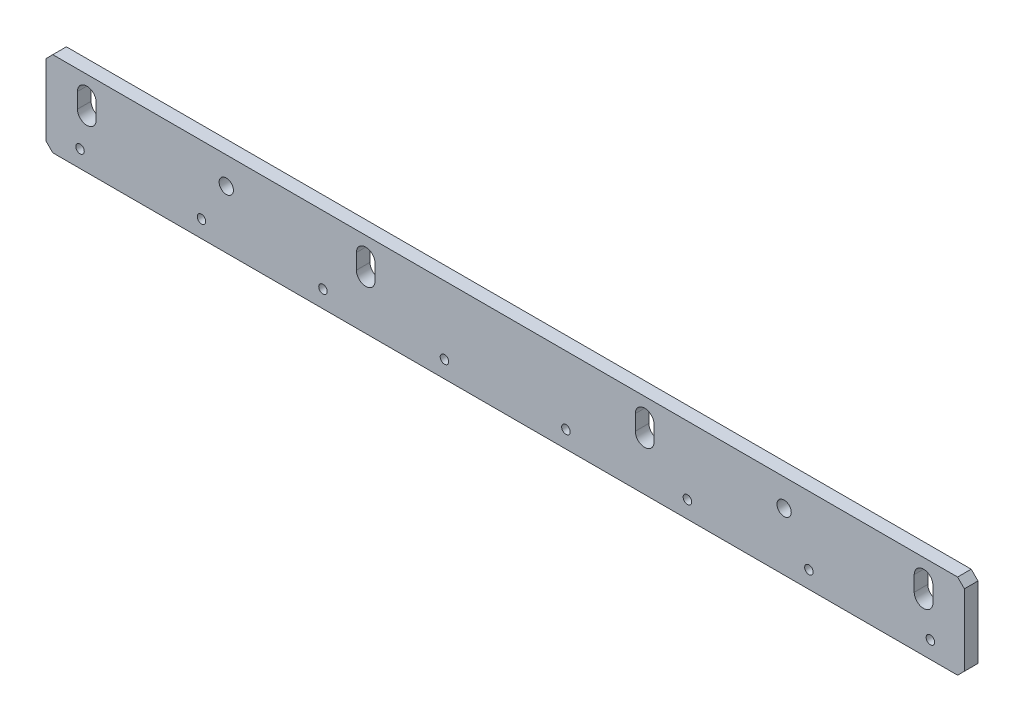
ISO-10303-21;
HEADER;
FILE_DESCRIPTION(('STEP AP214'),'2;1');
FILE_NAME('part.step','',(''),(''),'','','');
FILE_SCHEMA(('AUTOMOTIVE_DESIGN { 1 0 10303 214 1 1 1 1 }'));
ENDSEC;
DATA;
#1=APPLICATION_CONTEXT('core data for automotive mechanical design processes');
#2=APPLICATION_PROTOCOL_DEFINITION('international standard','automotive_design',2000,#1);
#3=PRODUCT_CONTEXT('',#1,'mechanical');
#4=PRODUCT('Part','Part','',(#3));
#5=PRODUCT_RELATED_PRODUCT_CATEGORY('part','',(#4));
#6=PRODUCT_DEFINITION_FORMATION('','',#4);
#7=PRODUCT_DEFINITION_CONTEXT('part definition',#1,'design');
#8=PRODUCT_DEFINITION('design','',#6,#7);
#9=PRODUCT_DEFINITION_SHAPE('','',#8);
#10=(LENGTH_UNIT() NAMED_UNIT(*) SI_UNIT(.MILLI.,.METRE.));
#11=(NAMED_UNIT(*) PLANE_ANGLE_UNIT() SI_UNIT($,.RADIAN.));
#12=(NAMED_UNIT(*) SI_UNIT($,.STERADIAN.) SOLID_ANGLE_UNIT());
#13=UNCERTAINTY_MEASURE_WITH_UNIT(LENGTH_MEASURE(1.E-05),#10,'distance_accuracy_value','');
#14=(GEOMETRIC_REPRESENTATION_CONTEXT(3) GLOBAL_UNCERTAINTY_ASSIGNED_CONTEXT((#13)) GLOBAL_UNIT_ASSIGNED_CONTEXT((#10,
#11,#12)) REPRESENTATION_CONTEXT('',''));
#15=CARTESIAN_POINT('',(0.,0.,0.));
#16=DIRECTION('',(0.,0.,1.));
#17=DIRECTION('',(1.,0.,0.));
#18=AXIS2_PLACEMENT_3D('',#15,#16,#17);
#19=CARTESIAN_POINT('',(125.,-7.49999999999999,4.));
#20=DIRECTION('',(0.,0.,1.));
#21=DIRECTION('',(1.,0.,0.));
#22=AXIS2_PLACEMENT_3D('',#19,#20,#21);
#23=CYLINDRICAL_SURFACE('',#22,1.25);
#24=CARTESIAN_POINT('',(125.,-7.49999999999999,0.));
#25=DIRECTION('',(0.,0.,1.));
#26=DIRECTION('',(1.,0.,0.));
#27=AXIS2_PLACEMENT_3D('',#24,#25,#26);
#28=CIRCLE('',#27,1.25);
#29=CARTESIAN_POINT('',(126.25,-7.49999999999999,0.));
#30=VERTEX_POINT('',#29);
#31=EDGE_CURVE('E468',#30,#30,#28,.T.);
#32=ORIENTED_EDGE('',*,*,#31,.F.);
#33=EDGE_LOOP('',(#32));
#34=FACE_BOUND('',#33,.T.);
#35=CARTESIAN_POINT('',(125.,-7.49999999999999,4.));
#36=DIRECTION('',(0.,0.,1.));
#37=DIRECTION('',(1.,0.,0.));
#38=AXIS2_PLACEMENT_3D('',#35,#36,#37);
#39=CIRCLE('',#38,1.25);
#40=CARTESIAN_POINT('',(126.25,-7.49999999999999,4.));
#41=VERTEX_POINT('',#40);
#42=EDGE_CURVE('E471',#41,#41,#39,.T.);
#43=ORIENTED_EDGE('',*,*,#42,.T.);
#44=EDGE_LOOP('',(#43));
#45=FACE_BOUND('',#44,.T.);
#46=ADVANCED_FACE('F114',(#34,#45),#23,.F.);
#47=CARTESIAN_POINT('',(89.2857142857142,-7.49999999999999,4.));
#48=DIRECTION('',(0.,0.,1.));
#49=DIRECTION('',(1.,0.,0.));
#50=AXIS2_PLACEMENT_3D('',#47,#48,#49);
#51=CYLINDRICAL_SURFACE('',#50,1.25);
#52=CARTESIAN_POINT('',(89.2857142857142,-7.49999999999999,0.));
#53=DIRECTION('',(0.,0.,1.));
#54=DIRECTION('',(1.,0.,0.));
#55=AXIS2_PLACEMENT_3D('',#52,#53,#54);
#56=CIRCLE('',#55,1.25);
#57=CARTESIAN_POINT('',(90.5357142857142,-7.49999999999999,0.));
#58=VERTEX_POINT('',#57);
#59=EDGE_CURVE('E462',#58,#58,#56,.T.);
#60=ORIENTED_EDGE('',*,*,#59,.F.);
#61=EDGE_LOOP('',(#60));
#62=FACE_BOUND('',#61,.T.);
#63=CARTESIAN_POINT('',(89.2857142857142,-7.49999999999999,4.));
#64=DIRECTION('',(0.,0.,1.));
#65=DIRECTION('',(1.,0.,0.));
#66=AXIS2_PLACEMENT_3D('',#63,#64,#65);
#67=CIRCLE('',#66,1.25);
#68=CARTESIAN_POINT('',(90.5357142857142,-7.49999999999999,4.));
#69=VERTEX_POINT('',#68);
#70=EDGE_CURVE('E465',#69,#69,#67,.T.);
#71=ORIENTED_EDGE('',*,*,#70,.T.);
#72=EDGE_LOOP('',(#71));
#73=FACE_BOUND('',#72,.T.);
#74=ADVANCED_FACE('F548',(#62,#73),#51,.F.);
#75=CARTESIAN_POINT('',(53.5714285714285,-7.5,4.));
#76=DIRECTION('',(0.,0.,1.));
#77=DIRECTION('',(1.,0.,0.));
#78=AXIS2_PLACEMENT_3D('',#75,#76,#77);
#79=CYLINDRICAL_SURFACE('',#78,1.25);
#80=CARTESIAN_POINT('',(53.5714285714285,-7.5,0.));
#81=DIRECTION('',(0.,0.,1.));
#82=DIRECTION('',(1.,0.,0.));
#83=AXIS2_PLACEMENT_3D('',#80,#81,#82);
#84=CIRCLE('',#83,1.25);
#85=CARTESIAN_POINT('',(54.8214285714285,-7.5,0.));
#86=VERTEX_POINT('',#85);
#87=EDGE_CURVE('E456',#86,#86,#84,.T.);
#88=ORIENTED_EDGE('',*,*,#87,.F.);
#89=EDGE_LOOP('',(#88));
#90=FACE_BOUND('',#89,.T.);
#91=CARTESIAN_POINT('',(53.5714285714285,-7.5,4.));
#92=DIRECTION('',(0.,0.,1.));
#93=DIRECTION('',(1.,0.,0.));
#94=AXIS2_PLACEMENT_3D('',#91,#92,#93);
#95=CIRCLE('',#94,1.25);
#96=CARTESIAN_POINT('',(54.8214285714285,-7.5,4.));
#97=VERTEX_POINT('',#96);
#98=EDGE_CURVE('E459',#97,#97,#95,.T.);
#99=ORIENTED_EDGE('',*,*,#98,.T.);
#100=EDGE_LOOP('',(#99));
#101=FACE_BOUND('',#100,.T.);
#102=ADVANCED_FACE('F554',(#90,#101),#79,.F.);
#103=CARTESIAN_POINT('',(17.8571428571428,-7.5,4.));
#104=DIRECTION('',(0.,0.,1.));
#105=DIRECTION('',(1.,0.,0.));
#106=AXIS2_PLACEMENT_3D('',#103,#104,#105);
#107=CYLINDRICAL_SURFACE('',#106,1.25);
#108=CARTESIAN_POINT('',(17.8571428571428,-7.5,0.));
#109=DIRECTION('',(0.,0.,1.));
#110=DIRECTION('',(1.,0.,0.));
#111=AXIS2_PLACEMENT_3D('',#108,#109,#110);
#112=CIRCLE('',#111,1.25);
#113=CARTESIAN_POINT('',(19.1071428571428,-7.5,0.));
#114=VERTEX_POINT('',#113);
#115=EDGE_CURVE('E450',#114,#114,#112,.T.);
#116=ORIENTED_EDGE('',*,*,#115,.F.);
#117=EDGE_LOOP('',(#116));
#118=FACE_BOUND('',#117,.T.);
#119=CARTESIAN_POINT('',(17.8571428571428,-7.5,4.));
#120=DIRECTION('',(0.,0.,1.));
#121=DIRECTION('',(1.,0.,0.));
#122=AXIS2_PLACEMENT_3D('',#119,#120,#121);
#123=CIRCLE('',#122,1.25);
#124=CARTESIAN_POINT('',(19.1071428571428,-7.5,4.));
#125=VERTEX_POINT('',#124);
#126=EDGE_CURVE('E453',#125,#125,#123,.T.);
#127=ORIENTED_EDGE('',*,*,#126,.T.);
#128=EDGE_LOOP('',(#127));
#129=FACE_BOUND('',#128,.T.);
#130=ADVANCED_FACE('F669',(#118,#129),#107,.F.);
#131=CARTESIAN_POINT('',(-17.8571428571429,-7.50000000000001,4.));
#132=DIRECTION('',(0.,0.,1.));
#133=DIRECTION('',(1.,0.,0.));
#134=AXIS2_PLACEMENT_3D('',#131,#132,#133);
#135=CYLINDRICAL_SURFACE('',#134,1.25);
#136=CARTESIAN_POINT('',(-17.8571428571429,-7.50000000000001,0.));
#137=DIRECTION('',(0.,0.,1.));
#138=DIRECTION('',(1.,0.,0.));
#139=AXIS2_PLACEMENT_3D('',#136,#137,#138);
#140=CIRCLE('',#139,1.25);
#141=CARTESIAN_POINT('',(-16.6071428571429,-7.50000000000001,0.));
#142=VERTEX_POINT('',#141);
#143=EDGE_CURVE('E444',#142,#142,#140,.T.);
#144=ORIENTED_EDGE('',*,*,#143,.F.);
#145=EDGE_LOOP('',(#144));
#146=FACE_BOUND('',#145,.T.);
#147=CARTESIAN_POINT('',(-17.8571428571429,-7.50000000000001,4.));
#148=DIRECTION('',(0.,0.,1.));
#149=DIRECTION('',(1.,0.,0.));
#150=AXIS2_PLACEMENT_3D('',#147,#148,#149);
#151=CIRCLE('',#150,1.25);
#152=CARTESIAN_POINT('',(-16.6071428571429,-7.50000000000001,4.));
#153=VERTEX_POINT('',#152);
#154=EDGE_CURVE('E447',#153,#153,#151,.T.);
#155=ORIENTED_EDGE('',*,*,#154,.T.);
#156=EDGE_LOOP('',(#155));
#157=FACE_BOUND('',#156,.T.);
#158=ADVANCED_FACE('F658',(#146,#157),#135,.F.);
#159=CARTESIAN_POINT('',(-53.5714285714286,-7.50000000000001,4.));
#160=DIRECTION('',(0.,0.,1.));
#161=DIRECTION('',(1.,0.,0.));
#162=AXIS2_PLACEMENT_3D('',#159,#160,#161);
#163=CYLINDRICAL_SURFACE('',#162,1.25);
#164=CARTESIAN_POINT('',(-53.5714285714286,-7.50000000000001,0.));
#165=DIRECTION('',(0.,0.,1.));
#166=DIRECTION('',(1.,0.,0.));
#167=AXIS2_PLACEMENT_3D('',#164,#165,#166);
#168=CIRCLE('',#167,1.25);
#169=CARTESIAN_POINT('',(-52.3214285714286,-7.50000000000001,0.));
#170=VERTEX_POINT('',#169);
#171=EDGE_CURVE('E438',#170,#170,#168,.T.);
#172=ORIENTED_EDGE('',*,*,#171,.F.);
#173=EDGE_LOOP('',(#172));
#174=FACE_BOUND('',#173,.T.);
#175=CARTESIAN_POINT('',(-53.5714285714286,-7.50000000000001,4.));
#176=DIRECTION('',(0.,0.,1.));
#177=DIRECTION('',(1.,0.,0.));
#178=AXIS2_PLACEMENT_3D('',#175,#176,#177);
#179=CIRCLE('',#178,1.25);
#180=CARTESIAN_POINT('',(-52.3214285714286,-7.50000000000001,4.));
#181=VERTEX_POINT('',#180);
#182=EDGE_CURVE('E441',#181,#181,#179,.T.);
#183=ORIENTED_EDGE('',*,*,#182,.T.);
#184=EDGE_LOOP('',(#183));
#185=FACE_BOUND('',#184,.T.);
#186=ADVANCED_FACE('F653',(#174,#185),#163,.F.);
#187=CARTESIAN_POINT('',(125.75,2.25000000000005,0.));
#188=DIRECTION('',(1.,0.,0.));
#189=DIRECTION('',(0.,0.,-1.));
#190=AXIS2_PLACEMENT_3D('',#187,#188,#189);
#191=PLANE('',#190);
#192=DIRECTION('',(0.,0.,-1.));
#193=VECTOR('',#192,1.);
#194=CARTESIAN_POINT('',(125.75,6.75000000000005,0.));
#195=LINE('',#194,#193);
#196=CARTESIAN_POINT('',(125.75,6.75000000000004,4.));
#197=VERTEX_POINT('',#196);
#198=CARTESIAN_POINT('',(125.75,6.75000000000004,0.));
#199=VERTEX_POINT('',#198);
#200=EDGE_CURVE('E426',#197,#199,#195,.T.);
#201=ORIENTED_EDGE('',*,*,#200,.T.);
#202=DIRECTION('',(0.,1.,0.));
#203=VECTOR('',#202,1.);
#204=CARTESIAN_POINT('',(125.75,2.25000000000004,0.));
#205=LINE('',#204,#203);
#206=CARTESIAN_POINT('',(125.75,2.25000000000004,0.));
#207=VERTEX_POINT('',#206);
#208=EDGE_CURVE('E412',#207,#199,#205,.T.);
#209=ORIENTED_EDGE('',*,*,#208,.F.);
#210=DIRECTION('',(0.,0.,-1.));
#211=VECTOR('',#210,1.);
#212=CARTESIAN_POINT('',(125.75,2.25000000000005,0.));
#213=LINE('',#212,#211);
#214=CARTESIAN_POINT('',(125.75,2.25000000000005,4.));
#215=VERTEX_POINT('',#214);
#216=EDGE_CURVE('E435',#215,#207,#213,.T.);
#217=ORIENTED_EDGE('',*,*,#216,.F.);
#218=DIRECTION('',(0.,1.,0.));
#219=VECTOR('',#218,1.);
#220=CARTESIAN_POINT('',(125.75,2.25000000000004,4.));
#221=LINE('',#220,#219);
#222=EDGE_CURVE('E417',#215,#197,#221,.T.);
#223=ORIENTED_EDGE('',*,*,#222,.T.);
#224=EDGE_LOOP('',(#201,#209,#217,#223));
#225=FACE_BOUND('',#224,.T.);
#226=ADVANCED_FACE('F657',(#225),#191,.F.);
#227=CARTESIAN_POINT('',(123.,2.25000000000005,4.));
#228=DIRECTION('',(0.,0.,1.));
#229=DIRECTION('',(1.,0.,0.));
#230=AXIS2_PLACEMENT_3D('',#227,#228,#229);
#231=CYLINDRICAL_SURFACE('',#230,2.75);
#232=CARTESIAN_POINT('',(123.,2.25000000000005,4.));
#233=DIRECTION('',(0.,0.,1.));
#234=DIRECTION('',(1.,0.,0.));
#235=AXIS2_PLACEMENT_3D('',#232,#233,#234);
#236=CIRCLE('',#235,2.75);
#237=CARTESIAN_POINT('',(120.25,2.25000000000005,4.));
#238=VERTEX_POINT('',#237);
#239=EDGE_CURVE('E420',#238,#215,#236,.T.);
#240=ORIENTED_EDGE('',*,*,#239,.T.);
#241=ORIENTED_EDGE('',*,*,#216,.T.);
#242=CARTESIAN_POINT('',(123.,2.25000000000005,0.));
#243=DIRECTION('',(0.,0.,1.));
#244=DIRECTION('',(1.,0.,0.));
#245=AXIS2_PLACEMENT_3D('',#242,#243,#244);
#246=CIRCLE('',#245,2.75);
#247=CARTESIAN_POINT('',(120.25,2.25000000000005,0.));
#248=VERTEX_POINT('',#247);
#249=EDGE_CURVE('E410',#248,#207,#246,.T.);
#250=ORIENTED_EDGE('',*,*,#249,.F.);
#251=DIRECTION('',(0.,0.,1.));
#252=VECTOR('',#251,1.);
#253=CARTESIAN_POINT('',(120.25,2.25000000000005,4.));
#254=LINE('',#253,#252);
#255=EDGE_CURVE('E432',#238,#248,#254,.F.);
#256=ORIENTED_EDGE('',*,*,#255,.F.);
#257=EDGE_LOOP('',(#240,#241,#250,#256));
#258=FACE_BOUND('',#257,.T.);
#259=ADVANCED_FACE('F868',(#258),#231,.F.);
#260=CARTESIAN_POINT('',(120.25,2.25000000000005,4.));
#261=DIRECTION('',(-1.,0.,0.));
#262=DIRECTION('',(0.,0.,1.));
#263=AXIS2_PLACEMENT_3D('',#260,#261,#262);
#264=PLANE('',#263);
#265=DIRECTION('',(0.,0.,1.));
#266=VECTOR('',#265,1.);
#267=CARTESIAN_POINT('',(120.25,6.75000000000005,4.));
#268=LINE('',#267,#266);
#269=CARTESIAN_POINT('',(120.25,6.75000000000005,0.));
#270=VERTEX_POINT('',#269);
#271=CARTESIAN_POINT('',(120.25,6.75000000000005,4.));
#272=VERTEX_POINT('',#271);
#273=EDGE_CURVE('E429',#270,#272,#268,.T.);
#274=ORIENTED_EDGE('',*,*,#273,.T.);
#275=DIRECTION('',(0.,1.,0.));
#276=VECTOR('',#275,1.);
#277=CARTESIAN_POINT('',(120.25,2.25000000000005,4.));
#278=LINE('',#277,#276);
#279=EDGE_CURVE('E423',#238,#272,#278,.T.);
#280=ORIENTED_EDGE('',*,*,#279,.F.);
#281=ORIENTED_EDGE('',*,*,#255,.T.);
#282=DIRECTION('',(0.,1.,0.));
#283=VECTOR('',#282,1.);
#284=CARTESIAN_POINT('',(120.25,2.25000000000005,0.));
#285=LINE('',#284,#283);
#286=EDGE_CURVE('E407',#248,#270,#285,.T.);
#287=ORIENTED_EDGE('',*,*,#286,.T.);
#288=EDGE_LOOP('',(#274,#280,#281,#287));
#289=FACE_BOUND('',#288,.T.);
#290=ADVANCED_FACE('F877',(#289),#264,.F.);
#291=CARTESIAN_POINT('',(123.,6.75000000000005,4.));
#292=DIRECTION('',(0.,0.,1.));
#293=DIRECTION('',(1.,0.,0.));
#294=AXIS2_PLACEMENT_3D('',#291,#292,#293);
#295=CYLINDRICAL_SURFACE('',#294,2.75);
#296=CARTESIAN_POINT('',(123.,6.75000000000005,0.));
#297=DIRECTION('',(0.,0.,1.));
#298=DIRECTION('',(1.,0.,0.));
#299=AXIS2_PLACEMENT_3D('',#296,#297,#298);
#300=CIRCLE('',#299,2.75);
#301=EDGE_CURVE('E405',#199,#270,#300,.T.);
#302=ORIENTED_EDGE('',*,*,#301,.F.);
#303=ORIENTED_EDGE('',*,*,#200,.F.);
#304=CARTESIAN_POINT('',(123.,6.75000000000005,4.));
#305=DIRECTION('',(0.,0.,1.));
#306=DIRECTION('',(1.,0.,0.));
#307=AXIS2_PLACEMENT_3D('',#304,#305,#306);
#308=CIRCLE('',#307,2.75);
#309=EDGE_CURVE('E415',#197,#272,#308,.T.);
#310=ORIENTED_EDGE('',*,*,#309,.T.);
#311=ORIENTED_EDGE('',*,*,#273,.F.);
#312=EDGE_LOOP('',(#302,#303,#310,#311));
#313=FACE_BOUND('',#312,.T.);
#314=ADVANCED_FACE('F886',(#313),#295,.F.);
#315=CARTESIAN_POINT('',(43.75,2.25000000000004,0.));
#316=DIRECTION('',(1.,0.,0.));
#317=DIRECTION('',(0.,0.,-1.));
#318=AXIS2_PLACEMENT_3D('',#315,#316,#317);
#319=PLANE('',#318);
#320=DIRECTION('',(0.,0.,-1.));
#321=VECTOR('',#320,1.);
#322=CARTESIAN_POINT('',(43.75,6.75000000000004,0.));
#323=LINE('',#322,#321);
#324=CARTESIAN_POINT('',(43.75,6.75000000000003,4.));
#325=VERTEX_POINT('',#324);
#326=CARTESIAN_POINT('',(43.75,6.75000000000003,0.));
#327=VERTEX_POINT('',#326);
#328=EDGE_CURVE('E393',#325,#327,#323,.T.);
#329=ORIENTED_EDGE('',*,*,#328,.T.);
#330=DIRECTION('',(0.,1.,0.));
#331=VECTOR('',#330,1.);
#332=CARTESIAN_POINT('',(43.75,2.25000000000003,0.));
#333=LINE('',#332,#331);
#334=CARTESIAN_POINT('',(43.75,2.25000000000003,0.));
#335=VERTEX_POINT('',#334);
#336=EDGE_CURVE('E379',#335,#327,#333,.T.);
#337=ORIENTED_EDGE('',*,*,#336,.F.);
#338=DIRECTION('',(0.,0.,-1.));
#339=VECTOR('',#338,1.);
#340=CARTESIAN_POINT('',(43.75,2.25000000000004,0.));
#341=LINE('',#340,#339);
#342=CARTESIAN_POINT('',(43.75,2.25000000000004,4.));
#343=VERTEX_POINT('',#342);
#344=EDGE_CURVE('E402',#343,#335,#341,.T.);
#345=ORIENTED_EDGE('',*,*,#344,.F.);
#346=DIRECTION('',(0.,1.,0.));
#347=VECTOR('',#346,1.);
#348=CARTESIAN_POINT('',(43.75,2.25000000000003,4.));
#349=LINE('',#348,#347);
#350=EDGE_CURVE('E384',#343,#325,#349,.T.);
#351=ORIENTED_EDGE('',*,*,#350,.T.);
#352=EDGE_LOOP('',(#329,#337,#345,#351));
#353=FACE_BOUND('',#352,.T.);
#354=ADVANCED_FACE('F895',(#353),#319,.F.);
#355=CARTESIAN_POINT('',(41.,2.25000000000004,4.));
#356=DIRECTION('',(0.,0.,1.));
#357=DIRECTION('',(1.,0.,0.));
#358=AXIS2_PLACEMENT_3D('',#355,#356,#357);
#359=CYLINDRICAL_SURFACE('',#358,2.75);
#360=CARTESIAN_POINT('',(41.,2.25000000000004,4.));
#361=DIRECTION('',(0.,0.,1.));
#362=DIRECTION('',(1.,0.,0.));
#363=AXIS2_PLACEMENT_3D('',#360,#361,#362);
#364=CIRCLE('',#363,2.75);
#365=CARTESIAN_POINT('',(38.25,2.25000000000004,4.));
#366=VERTEX_POINT('',#365);
#367=EDGE_CURVE('E387',#366,#343,#364,.T.);
#368=ORIENTED_EDGE('',*,*,#367,.T.);
#369=ORIENTED_EDGE('',*,*,#344,.T.);
#370=CARTESIAN_POINT('',(41.,2.25000000000004,0.));
#371=DIRECTION('',(0.,0.,1.));
#372=DIRECTION('',(1.,0.,0.));
#373=AXIS2_PLACEMENT_3D('',#370,#371,#372);
#374=CIRCLE('',#373,2.75);
#375=CARTESIAN_POINT('',(38.25,2.25000000000004,0.));
#376=VERTEX_POINT('',#375);
#377=EDGE_CURVE('E377',#376,#335,#374,.T.);
#378=ORIENTED_EDGE('',*,*,#377,.F.);
#379=DIRECTION('',(0.,0.,1.));
#380=VECTOR('',#379,1.);
#381=CARTESIAN_POINT('',(38.25,2.25000000000004,4.));
#382=LINE('',#381,#380);
#383=EDGE_CURVE('E399',#366,#376,#382,.F.);
#384=ORIENTED_EDGE('',*,*,#383,.F.);
#385=EDGE_LOOP('',(#368,#369,#378,#384));
#386=FACE_BOUND('',#385,.T.);
#387=ADVANCED_FACE('F904',(#386),#359,.F.);
#388=CARTESIAN_POINT('',(38.25,2.25000000000004,4.));
#389=DIRECTION('',(-1.,0.,0.));
#390=DIRECTION('',(0.,0.,1.));
#391=AXIS2_PLACEMENT_3D('',#388,#389,#390);
#392=PLANE('',#391);
#393=DIRECTION('',(0.,0.,1.));
#394=VECTOR('',#393,1.);
#395=CARTESIAN_POINT('',(38.25,6.75000000000004,4.));
#396=LINE('',#395,#394);
#397=CARTESIAN_POINT('',(38.25,6.75000000000004,0.));
#398=VERTEX_POINT('',#397);
#399=CARTESIAN_POINT('',(38.25,6.75000000000004,4.));
#400=VERTEX_POINT('',#399);
#401=EDGE_CURVE('E396',#398,#400,#396,.T.);
#402=ORIENTED_EDGE('',*,*,#401,.T.);
#403=DIRECTION('',(0.,1.,0.));
#404=VECTOR('',#403,1.);
#405=CARTESIAN_POINT('',(38.25,2.25000000000004,4.));
#406=LINE('',#405,#404);
#407=EDGE_CURVE('E390',#366,#400,#406,.T.);
#408=ORIENTED_EDGE('',*,*,#407,.F.);
#409=ORIENTED_EDGE('',*,*,#383,.T.);
#410=DIRECTION('',(0.,1.,0.));
#411=VECTOR('',#410,1.);
#412=CARTESIAN_POINT('',(38.25,2.25000000000004,0.));
#413=LINE('',#412,#411);
#414=EDGE_CURVE('E374',#376,#398,#413,.T.);
#415=ORIENTED_EDGE('',*,*,#414,.T.);
#416=EDGE_LOOP('',(#402,#408,#409,#415));
#417=FACE_BOUND('',#416,.T.);
#418=ADVANCED_FACE('F913',(#417),#392,.F.);
#419=CARTESIAN_POINT('',(41.,6.75000000000004,4.));
#420=DIRECTION('',(0.,0.,1.));
#421=DIRECTION('',(1.,0.,0.));
#422=AXIS2_PLACEMENT_3D('',#419,#420,#421);
#423=CYLINDRICAL_SURFACE('',#422,2.75);
#424=CARTESIAN_POINT('',(41.,6.75000000000004,0.));
#425=DIRECTION('',(0.,0.,1.));
#426=DIRECTION('',(1.,0.,0.));
#427=AXIS2_PLACEMENT_3D('',#424,#425,#426);
#428=CIRCLE('',#427,2.75);
#429=EDGE_CURVE('E363',#327,#398,#428,.T.);
#430=ORIENTED_EDGE('',*,*,#429,.F.);
#431=ORIENTED_EDGE('',*,*,#328,.F.);
#432=CARTESIAN_POINT('',(41.,6.75000000000004,4.));
#433=DIRECTION('',(0.,0.,1.));
#434=DIRECTION('',(1.,0.,0.));
#435=AXIS2_PLACEMENT_3D('',#432,#433,#434);
#436=CIRCLE('',#435,2.75);
#437=EDGE_CURVE('E382',#325,#400,#436,.T.);
#438=ORIENTED_EDGE('',*,*,#437,.T.);
#439=ORIENTED_EDGE('',*,*,#401,.F.);
#440=EDGE_LOOP('',(#430,#431,#438,#439));
#441=FACE_BOUND('',#440,.T.);
#442=ADVANCED_FACE('F749',(#441),#423,.F.);
#443=CARTESIAN_POINT('',(-135.,-12.5,4.));
#444=DIRECTION('',(1.,0.,0.));
#445=DIRECTION('',(0.,0.,-1.));
#446=AXIS2_PLACEMENT_3D('',#443,#444,#445);
#447=PLANE('',#446);
#448=DIRECTION('',(0.,-1.,0.));
#449=VECTOR('',#448,1.);
#450=CARTESIAN_POINT('',(-135.,-12.5,0.));
#451=LINE('',#450,#449);
#452=CARTESIAN_POINT('',(-135.,10.5,0.));
#453=VERTEX_POINT('',#452);
#454=CARTESIAN_POINT('',(-135.,-10.5000000000001,0.));
#455=VERTEX_POINT('',#454);
#456=EDGE_CURVE('E351',#453,#455,#451,.T.);
#457=ORIENTED_EDGE('',*,*,#456,.T.);
#458=DIRECTION('',(0.,0.,1.));
#459=VECTOR('',#458,1.);
#460=CARTESIAN_POINT('',(-135.,-10.5000000000001,4.));
#461=LINE('',#460,#459);
#462=CARTESIAN_POINT('',(-135.,-10.5000000000001,4.));
#463=VERTEX_POINT('',#462);
#464=EDGE_CURVE('E13',#455,#463,#461,.T.);
#465=ORIENTED_EDGE('',*,*,#464,.T.);
#466=DIRECTION('',(0.,-1.,0.));
#467=VECTOR('',#466,1.);
#468=CARTESIAN_POINT('',(-135.,-12.5,4.));
#469=LINE('',#468,#467);
#470=CARTESIAN_POINT('',(-135.,10.5,4.));
#471=VERTEX_POINT('',#470);
#472=EDGE_CURVE('E352',#471,#463,#469,.T.);
#473=ORIENTED_EDGE('',*,*,#472,.F.);
#474=DIRECTION('',(0.,0.,-1.));
#475=VECTOR('',#474,1.);
#476=CARTESIAN_POINT('',(-135.,10.5,4.));
#477=LINE('',#476,#475);
#478=EDGE_CURVE('E123',#471,#453,#477,.T.);
#479=ORIENTED_EDGE('',*,*,#478,.T.);
#480=EDGE_LOOP('',(#457,#465,#473,#479));
#481=FACE_BOUND('',#480,.T.);
#482=ADVANCED_FACE('F507',(#481),#447,.F.);
#483=CARTESIAN_POINT('',(135.,-12.5,4.));
#484=DIRECTION('',(0.,1.,0.));
#485=DIRECTION('',(-1.,0.,0.));
#486=AXIS2_PLACEMENT_3D('',#483,#484,#485);
#487=PLANE('',#486);
#488=DIRECTION('',(1.,0.,0.));
#489=VECTOR('',#488,1.);
#490=CARTESIAN_POINT('',(135.,-12.5,0.));
#491=LINE('',#490,#489);
#492=CARTESIAN_POINT('',(-133.,-12.5,0.));
#493=VERTEX_POINT('',#492);
#494=CARTESIAN_POINT('',(133.,-12.5,0.));
#495=VERTEX_POINT('',#494);
#496=EDGE_CURVE('E366',#493,#495,#491,.T.);
#497=ORIENTED_EDGE('',*,*,#496,.T.);
#498=DIRECTION('',(0.,0.,1.));
#499=VECTOR('',#498,1.);
#500=CARTESIAN_POINT('',(133.,-12.5,4.));
#501=LINE('',#500,#499);
#502=CARTESIAN_POINT('',(133.,-12.5,4.));
#503=VERTEX_POINT('',#502);
#504=EDGE_CURVE('E490',#495,#503,#501,.T.);
#505=ORIENTED_EDGE('',*,*,#504,.T.);
#506=DIRECTION('',(1.,0.,0.));
#507=VECTOR('',#506,1.);
#508=CARTESIAN_POINT('',(135.,-12.5,4.));
#509=LINE('',#508,#507);
#510=CARTESIAN_POINT('',(-133.,-12.5,4.));
#511=VERTEX_POINT('',#510);
#512=EDGE_CURVE('E355',#511,#503,#509,.T.);
#513=ORIENTED_EDGE('',*,*,#512,.F.);
#514=DIRECTION('',(0.,0.,-1.));
#515=VECTOR('',#514,1.);
#516=CARTESIAN_POINT('',(-133.,-12.5,4.));
#517=LINE('',#516,#515);
#518=EDGE_CURVE('E487',#511,#493,#517,.T.);
#519=ORIENTED_EDGE('',*,*,#518,.T.);
#520=EDGE_LOOP('',(#497,#505,#513,#519));
#521=FACE_BOUND('',#520,.T.);
#522=ADVANCED_FACE('F522',(#521),#487,.F.);
#523=CARTESIAN_POINT('',(135.,-12.5,4.));
#524=DIRECTION('',(-1.,0.,0.));
#525=DIRECTION('',(0.,0.,1.));
#526=AXIS2_PLACEMENT_3D('',#523,#524,#525);
#527=PLANE('',#526);
#528=DIRECTION('',(0.,1.,0.));
#529=VECTOR('',#528,1.);
#530=CARTESIAN_POINT('',(135.,-12.5,4.));
#531=LINE('',#530,#529);
#532=CARTESIAN_POINT('',(135.,-10.5,4.));
#533=VERTEX_POINT('',#532);
#534=CARTESIAN_POINT('',(135.,10.5,4.));
#535=VERTEX_POINT('',#534);
#536=EDGE_CURVE('E359',#533,#535,#531,.T.);
#537=ORIENTED_EDGE('',*,*,#536,.F.);
#538=DIRECTION('',(0.,0.,-1.));
#539=VECTOR('',#538,1.);
#540=CARTESIAN_POINT('',(135.,-10.5,4.));
#541=LINE('',#540,#539);
#542=CARTESIAN_POINT('',(135.,-10.5,0.));
#543=VERTEX_POINT('',#542);
#544=EDGE_CURVE('E476',#533,#543,#541,.T.);
#545=ORIENTED_EDGE('',*,*,#544,.T.);
#546=DIRECTION('',(0.,1.,0.));
#547=VECTOR('',#546,1.);
#548=CARTESIAN_POINT('',(135.,-12.5,0.));
#549=LINE('',#548,#547);
#550=CARTESIAN_POINT('',(135.,10.5,0.));
#551=VERTEX_POINT('',#550);
#552=EDGE_CURVE('E369',#543,#551,#549,.T.);
#553=ORIENTED_EDGE('',*,*,#552,.T.);
#554=DIRECTION('',(0.,0.,1.));
#555=VECTOR('',#554,1.);
#556=CARTESIAN_POINT('',(135.,10.5,4.));
#557=LINE('',#556,#555);
#558=EDGE_CURVE('E474',#551,#535,#557,.T.);
#559=ORIENTED_EDGE('',*,*,#558,.T.);
#560=EDGE_LOOP('',(#537,#545,#553,#559));
#561=FACE_BOUND('',#560,.T.);
#562=ADVANCED_FACE('F532',(#561),#527,.F.);
#563=CARTESIAN_POINT('',(135.,12.5,4.));
#564=DIRECTION('',(0.,-1.,0.));
#565=DIRECTION('',(1.,0.,0.));
#566=AXIS2_PLACEMENT_3D('',#563,#564,#565);
#567=PLANE('',#566);
#568=DIRECTION('',(-1.,0.,0.));
#569=VECTOR('',#568,1.);
#570=CARTESIAN_POINT('',(135.,12.5,4.));
#571=LINE('',#570,#569);
#572=CARTESIAN_POINT('',(133.,12.5,4.));
#573=VERTEX_POINT('',#572);
#574=CARTESIAN_POINT('',(-133.,12.5,4.));
#575=VERTEX_POINT('',#574);
#576=EDGE_CURVE('E361',#573,#575,#571,.T.);
#577=ORIENTED_EDGE('',*,*,#576,.F.);
#578=DIRECTION('',(0.,0.,-1.));
#579=VECTOR('',#578,1.);
#580=CARTESIAN_POINT('',(133.,12.5,4.));
#581=LINE('',#580,#579);
#582=CARTESIAN_POINT('',(133.,12.5,0.));
#583=VERTEX_POINT('',#582);
#584=EDGE_CURVE('E500',#573,#583,#581,.T.);
#585=ORIENTED_EDGE('',*,*,#584,.T.);
#586=DIRECTION('',(-1.,0.,0.));
#587=VECTOR('',#586,1.);
#588=CARTESIAN_POINT('',(135.,12.5,0.));
#589=LINE('',#588,#587);
#590=CARTESIAN_POINT('',(-133.,12.5,0.));
#591=VERTEX_POINT('',#590);
#592=EDGE_CURVE('E356',#583,#591,#589,.T.);
#593=ORIENTED_EDGE('',*,*,#592,.T.);
#594=DIRECTION('',(0.,0.,1.));
#595=VECTOR('',#594,1.);
#596=CARTESIAN_POINT('',(-133.,12.5,4.));
#597=LINE('',#596,#595);
#598=EDGE_CURVE('E130',#591,#575,#597,.T.);
#599=ORIENTED_EDGE('',*,*,#598,.T.);
#600=EDGE_LOOP('',(#577,#585,#593,#599));
#601=FACE_BOUND('',#600,.T.);
#602=ADVANCED_FACE('F537',(#601),#567,.F.);
#603=CARTESIAN_POINT('',(0.,0.,4.));
#604=DIRECTION('',(0.,0.,1.));
#605=DIRECTION('',(1.,0.,0.));
#606=AXIS2_PLACEMENT_3D('',#603,#604,#605);
#607=PLANE('',#606);
#608=CARTESIAN_POINT('',(82.,4.50000000000003,4.));
#609=DIRECTION('',(0.,0.,1.));
#610=DIRECTION('',(1.,0.,0.));
#611=AXIS2_PLACEMENT_3D('',#608,#609,#610);
#612=CIRCLE('',#611,2.09999999999999);
#613=CARTESIAN_POINT('',(84.1,4.50000000000003,4.));
#614=VERTEX_POINT('',#613);
#615=EDGE_CURVE('E1034',#614,#614,#612,.T.);
#616=ORIENTED_EDGE('',*,*,#615,.F.);
#617=EDGE_LOOP('',(#616));
#618=FACE_BOUND('',#617,.T.);
#619=CARTESIAN_POINT('',(-82.,4.50000000000003,4.));
#620=DIRECTION('',(0.,0.,1.));
#621=DIRECTION('',(1.,0.,0.));
#622=AXIS2_PLACEMENT_3D('',#619,#620,#621);
#623=CIRCLE('',#622,2.09999999999999);
#624=CARTESIAN_POINT('',(-79.9,4.50000000000003,4.));
#625=VERTEX_POINT('',#624);
#626=EDGE_CURVE('E1028',#625,#625,#623,.T.);
#627=ORIENTED_EDGE('',*,*,#626,.F.);
#628=EDGE_LOOP('',(#627));
#629=FACE_BOUND('',#628,.T.);
#630=CARTESIAN_POINT('',(-89.2857142857143,-7.50000000000001,4.));
#631=DIRECTION('',(0.,0.,1.));
#632=DIRECTION('',(1.,0.,0.));
#633=AXIS2_PLACEMENT_3D('',#630,#631,#632);
#634=CIRCLE('',#633,1.25);
#635=CARTESIAN_POINT('',(-88.0357142857143,-7.50000000000001,4.));
#636=VERTEX_POINT('',#635);
#637=EDGE_CURVE('E1019',#636,#636,#634,.T.);
#638=ORIENTED_EDGE('',*,*,#637,.F.);
#639=EDGE_LOOP('',(#638));
#640=FACE_BOUND('',#639,.T.);
#641=CARTESIAN_POINT('',(-125.,-7.50000000000002,4.));
#642=DIRECTION('',(0.,0.,1.));
#643=DIRECTION('',(1.,0.,0.));
#644=AXIS2_PLACEMENT_3D('',#641,#642,#643);
#645=CIRCLE('',#644,1.25);
#646=CARTESIAN_POINT('',(-123.75,-7.50000000000002,4.));
#647=VERTEX_POINT('',#646);
#648=EDGE_CURVE('E1016',#647,#647,#645,.T.);
#649=ORIENTED_EDGE('',*,*,#648,.F.);
#650=EDGE_LOOP('',(#649));
#651=FACE_BOUND('',#650,.T.);
#652=CARTESIAN_POINT('',(-41.,6.75000000000003,4.));
#653=DIRECTION('',(0.,0.,1.));
#654=DIRECTION('',(1.,0.,0.));
#655=AXIS2_PLACEMENT_3D('',#652,#653,#654);
#656=CIRCLE('',#655,2.75);
#657=CARTESIAN_POINT('',(-38.25,6.75000000000002,4.));
#658=VERTEX_POINT('',#657);
#659=CARTESIAN_POINT('',(-43.75,6.75000000000003,4.));
#660=VERTEX_POINT('',#659);
#661=EDGE_CURVE('E316',#658,#660,#656,.T.);
#662=ORIENTED_EDGE('',*,*,#661,.F.);
#663=DIRECTION('',(0.,1.,0.));
#664=VECTOR('',#663,1.);
#665=CARTESIAN_POINT('',(-38.25,2.25000000000002,4.));
#666=LINE('',#665,#664);
#667=CARTESIAN_POINT('',(-38.25,2.25000000000002,4.));
#668=VERTEX_POINT('',#667);
#669=EDGE_CURVE('E288',#668,#658,#666,.T.);
#670=ORIENTED_EDGE('',*,*,#669,.F.);
#671=CARTESIAN_POINT('',(-41.,2.25000000000003,4.));
#672=DIRECTION('',(0.,0.,1.));
#673=DIRECTION('',(1.,0.,0.));
#674=AXIS2_PLACEMENT_3D('',#671,#672,#673);
#675=CIRCLE('',#674,2.75);
#676=CARTESIAN_POINT('',(-43.75,2.25000000000003,4.));
#677=VERTEX_POINT('',#676);
#678=EDGE_CURVE('E296',#677,#668,#675,.T.);
#679=ORIENTED_EDGE('',*,*,#678,.F.);
#680=DIRECTION('',(0.,1.,0.));
#681=VECTOR('',#680,1.);
#682=CARTESIAN_POINT('',(-43.75,2.25000000000003,4.));
#683=LINE('',#682,#681);
#684=EDGE_CURVE('E310',#677,#660,#683,.T.);
#685=ORIENTED_EDGE('',*,*,#684,.T.);
#686=EDGE_LOOP('',(#662,#670,#679,#685));
#687=FACE_BOUND('',#686,.T.);
#688=DIRECTION('',(0.,1.,0.));
#689=VECTOR('',#688,1.);
#690=CARTESIAN_POINT('',(-120.25,2.25000000000001,4.));
#691=LINE('',#690,#689);
#692=CARTESIAN_POINT('',(-120.25,2.25000000000002,4.));
#693=VERTEX_POINT('',#692);
#694=CARTESIAN_POINT('',(-120.25,6.75000000000001,4.));
#695=VERTEX_POINT('',#694);
#696=EDGE_CURVE('E319',#693,#695,#691,.T.);
#697=ORIENTED_EDGE('',*,*,#696,.F.);
#698=CARTESIAN_POINT('',(-123.,2.25000000000002,4.));
#699=DIRECTION('',(0.,0.,1.));
#700=DIRECTION('',(1.,0.,0.));
#701=AXIS2_PLACEMENT_3D('',#698,#699,#700);
#702=CIRCLE('',#701,2.75);
#703=CARTESIAN_POINT('',(-125.75,2.25000000000002,4.));
#704=VERTEX_POINT('',#703);
#705=EDGE_CURVE('E332',#704,#693,#702,.T.);
#706=ORIENTED_EDGE('',*,*,#705,.F.);
#707=DIRECTION('',(0.,1.,0.));
#708=VECTOR('',#707,1.);
#709=CARTESIAN_POINT('',(-125.75,2.25000000000002,4.));
#710=LINE('',#709,#708);
#711=CARTESIAN_POINT('',(-125.75,6.75000000000002,4.));
#712=VERTEX_POINT('',#711);
#713=EDGE_CURVE('E326',#704,#712,#710,.T.);
#714=ORIENTED_EDGE('',*,*,#713,.T.);
#715=CARTESIAN_POINT('',(-123.,6.75000000000002,4.));
#716=DIRECTION('',(0.,0.,1.));
#717=DIRECTION('',(1.,0.,0.));
#718=AXIS2_PLACEMENT_3D('',#715,#716,#717);
#719=CIRCLE('',#718,2.75);
#720=EDGE_CURVE('E343',#695,#712,#719,.T.);
#721=ORIENTED_EDGE('',*,*,#720,.F.);
#722=EDGE_LOOP('',(#697,#706,#714,#721));
#723=FACE_BOUND('',#722,.T.);
#724=ORIENTED_EDGE('',*,*,#512,.T.);
#725=DIRECTION('',(-0.707106781186548,-0.707106781186548,0.));
#726=VECTOR('',#725,1.);
#727=CARTESIAN_POINT('',(72.75,-72.75,4.));
#728=LINE('',#727,#726);
#729=EDGE_CURVE('E497',#503,#533,#728,.F.);
#730=ORIENTED_EDGE('',*,*,#729,.T.);
#731=ORIENTED_EDGE('',*,*,#536,.T.);
#732=DIRECTION('',(0.707106781186548,-0.707106781186547,0.));
#733=VECTOR('',#732,1.);
#734=CARTESIAN_POINT('',(72.75,72.75,4.));
#735=LINE('',#734,#733);
#736=EDGE_CURVE('E137',#535,#573,#735,.F.);
#737=ORIENTED_EDGE('',*,*,#736,.T.);
#738=ORIENTED_EDGE('',*,*,#576,.T.);
#739=DIRECTION('',(0.707106781186552,0.707106781186543,0.));
#740=VECTOR('',#739,1.);
#741=CARTESIAN_POINT('',(-72.7499999999991,72.7500000000001,4.));
#742=LINE('',#741,#740);
#743=EDGE_CURVE('E492',#575,#471,#742,.F.);
#744=ORIENTED_EDGE('',*,*,#743,.T.);
#745=ORIENTED_EDGE('',*,*,#472,.T.);
#746=DIRECTION('',(-0.707106781186548,0.707106781186548,0.));
#747=VECTOR('',#746,1.);
#748=CARTESIAN_POINT('',(-72.75,-72.75,4.));
#749=LINE('',#748,#747);
#750=EDGE_CURVE('E494',#463,#511,#749,.F.);
#751=ORIENTED_EDGE('',*,*,#750,.T.);
#752=EDGE_LOOP('',(#724,#730,#731,#737,#738,#744,#745,#751));
#753=FACE_BOUND('',#752,.T.);
#754=ORIENTED_EDGE('',*,*,#437,.F.);
#755=ORIENTED_EDGE('',*,*,#350,.F.);
#756=ORIENTED_EDGE('',*,*,#367,.F.);
#757=ORIENTED_EDGE('',*,*,#407,.T.);
#758=EDGE_LOOP('',(#754,#755,#756,#757));
#759=FACE_BOUND('',#758,.T.);
#760=ORIENTED_EDGE('',*,*,#309,.F.);
#761=ORIENTED_EDGE('',*,*,#222,.F.);
#762=ORIENTED_EDGE('',*,*,#239,.F.);
#763=ORIENTED_EDGE('',*,*,#279,.T.);
#764=EDGE_LOOP('',(#760,#761,#762,#763));
#765=FACE_BOUND('',#764,.T.);
#766=ORIENTED_EDGE('',*,*,#182,.F.);
#767=EDGE_LOOP('',(#766));
#768=FACE_BOUND('',#767,.T.);
#769=ORIENTED_EDGE('',*,*,#154,.F.);
#770=EDGE_LOOP('',(#769));
#771=FACE_BOUND('',#770,.T.);
#772=ORIENTED_EDGE('',*,*,#126,.F.);
#773=EDGE_LOOP('',(#772));
#774=FACE_BOUND('',#773,.T.);
#775=ORIENTED_EDGE('',*,*,#98,.F.);
#776=EDGE_LOOP('',(#775));
#777=FACE_BOUND('',#776,.T.);
#778=ORIENTED_EDGE('',*,*,#70,.F.);
#779=EDGE_LOOP('',(#778));
#780=FACE_BOUND('',#779,.T.);
#781=ORIENTED_EDGE('',*,*,#42,.F.);
#782=EDGE_LOOP('',(#781));
#783=FACE_BOUND('',#782,.T.);
#784=ADVANCED_FACE('F525',(#618,#629,#640,#651,#687,#723,#753,#759,#765,#768,#771,#774,#777,
#780,#783),#607,.T.);
#785=CARTESIAN_POINT('',(0.,0.,0.));
#786=DIRECTION('',(0.,0.,1.));
#787=DIRECTION('',(1.,0.,0.));
#788=AXIS2_PLACEMENT_3D('',#785,#786,#787);
#789=PLANE('',#788);
#790=CARTESIAN_POINT('',(82.,4.50000000000003,0.));
#791=DIRECTION('',(0.,0.,1.));
#792=DIRECTION('',(1.,0.,0.));
#793=AXIS2_PLACEMENT_3D('',#790,#791,#792);
#794=CIRCLE('',#793,2.1);
#795=CARTESIAN_POINT('',(84.1,4.50000000000003,0.));
#796=VERTEX_POINT('',#795);
#797=EDGE_CURVE('E1031',#796,#796,#794,.T.);
#798=ORIENTED_EDGE('',*,*,#797,.T.);
#799=EDGE_LOOP('',(#798));
#800=FACE_BOUND('',#799,.T.);
#801=CARTESIAN_POINT('',(-82.,4.50000000000003,0.));
#802=DIRECTION('',(0.,0.,1.));
#803=DIRECTION('',(1.,0.,0.));
#804=AXIS2_PLACEMENT_3D('',#801,#802,#803);
#805=CIRCLE('',#804,2.1);
#806=CARTESIAN_POINT('',(-79.9,4.50000000000003,0.));
#807=VERTEX_POINT('',#806);
#808=EDGE_CURVE('E1025',#807,#807,#805,.T.);
#809=ORIENTED_EDGE('',*,*,#808,.T.);
#810=EDGE_LOOP('',(#809));
#811=FACE_BOUND('',#810,.T.);
#812=CARTESIAN_POINT('',(-89.2857142857143,-7.50000000000001,0.));
#813=DIRECTION('',(0.,0.,1.));
#814=DIRECTION('',(1.,0.,0.));
#815=AXIS2_PLACEMENT_3D('',#812,#813,#814);
#816=CIRCLE('',#815,1.25);
#817=CARTESIAN_POINT('',(-88.0357142857143,-7.50000000000001,0.));
#818=VERTEX_POINT('',#817);
#819=EDGE_CURVE('E1022',#818,#818,#816,.T.);
#820=ORIENTED_EDGE('',*,*,#819,.T.);
#821=EDGE_LOOP('',(#820));
#822=FACE_BOUND('',#821,.T.);
#823=CARTESIAN_POINT('',(-125.,-7.50000000000002,0.));
#824=DIRECTION('',(0.,0.,1.));
#825=DIRECTION('',(1.,0.,0.));
#826=AXIS2_PLACEMENT_3D('',#823,#824,#825);
#827=CIRCLE('',#826,1.25);
#828=CARTESIAN_POINT('',(-123.75,-7.50000000000002,0.));
#829=VERTEX_POINT('',#828);
#830=EDGE_CURVE('E289',#829,#829,#827,.T.);
#831=ORIENTED_EDGE('',*,*,#830,.T.);
#832=EDGE_LOOP('',(#831));
#833=FACE_BOUND('',#832,.T.);
#834=DIRECTION('',(0.,1.,0.));
#835=VECTOR('',#834,1.);
#836=CARTESIAN_POINT('',(-38.25,2.25000000000002,0.));
#837=LINE('',#836,#835);
#838=CARTESIAN_POINT('',(-38.25,2.25000000000002,0.));
#839=VERTEX_POINT('',#838);
#840=CARTESIAN_POINT('',(-38.25,6.75000000000003,0.));
#841=VERTEX_POINT('',#840);
#842=EDGE_CURVE('E278',#839,#841,#837,.T.);
#843=ORIENTED_EDGE('',*,*,#842,.T.);
#844=CARTESIAN_POINT('',(-41.,6.75000000000003,0.));
#845=DIRECTION('',(0.,0.,1.));
#846=DIRECTION('',(1.,0.,0.));
#847=AXIS2_PLACEMENT_3D('',#844,#845,#846);
#848=CIRCLE('',#847,2.75);
#849=CARTESIAN_POINT('',(-43.75,6.75000000000003,0.));
#850=VERTEX_POINT('',#849);
#851=EDGE_CURVE('E314',#841,#850,#848,.T.);
#852=ORIENTED_EDGE('',*,*,#851,.T.);
#853=DIRECTION('',(0.,1.,0.));
#854=VECTOR('',#853,1.);
#855=CARTESIAN_POINT('',(-43.75,2.25000000000003,0.));
#856=LINE('',#855,#854);
#857=CARTESIAN_POINT('',(-43.75,2.25000000000003,0.));
#858=VERTEX_POINT('',#857);
#859=EDGE_CURVE('E302',#858,#850,#856,.T.);
#860=ORIENTED_EDGE('',*,*,#859,.F.);
#861=CARTESIAN_POINT('',(-41.,2.25000000000003,0.));
#862=DIRECTION('',(0.,0.,1.));
#863=DIRECTION('',(1.,0.,0.));
#864=AXIS2_PLACEMENT_3D('',#861,#862,#863);
#865=CIRCLE('',#864,2.75);
#866=EDGE_CURVE('E293',#858,#839,#865,.T.);
#867=ORIENTED_EDGE('',*,*,#866,.T.);
#868=EDGE_LOOP('',(#843,#852,#860,#867));
#869=FACE_BOUND('',#868,.T.);
#870=DIRECTION('',(0.,1.,0.));
#871=VECTOR('',#870,1.);
#872=CARTESIAN_POINT('',(-120.25,2.25000000000001,0.));
#873=LINE('',#872,#871);
#874=CARTESIAN_POINT('',(-120.25,2.25000000000001,0.));
#875=VERTEX_POINT('',#874);
#876=CARTESIAN_POINT('',(-120.25,6.75000000000001,0.));
#877=VERTEX_POINT('',#876);
#878=EDGE_CURVE('E321',#875,#877,#873,.T.);
#879=ORIENTED_EDGE('',*,*,#878,.T.);
#880=CARTESIAN_POINT('',(-123.,6.75000000000002,0.));
#881=DIRECTION('',(0.,0.,1.));
#882=DIRECTION('',(1.,0.,0.));
#883=AXIS2_PLACEMENT_3D('',#880,#881,#882);
#884=CIRCLE('',#883,2.75);
#885=CARTESIAN_POINT('',(-125.75,6.75000000000002,0.));
#886=VERTEX_POINT('',#885);
#887=EDGE_CURVE('E345',#877,#886,#884,.T.);
#888=ORIENTED_EDGE('',*,*,#887,.T.);
#889=DIRECTION('',(0.,1.,0.));
#890=VECTOR('',#889,1.);
#891=CARTESIAN_POINT('',(-125.75,2.25000000000002,0.));
#892=LINE('',#891,#890);
#893=CARTESIAN_POINT('',(-125.75,2.25000000000002,0.));
#894=VERTEX_POINT('',#893);
#895=EDGE_CURVE('E324',#894,#886,#892,.T.);
#896=ORIENTED_EDGE('',*,*,#895,.F.);
#897=CARTESIAN_POINT('',(-123.,2.25000000000002,0.));
#898=DIRECTION('',(0.,0.,1.));
#899=DIRECTION('',(1.,0.,0.));
#900=AXIS2_PLACEMENT_3D('',#897,#898,#899);
#901=CIRCLE('',#900,2.75);
#902=EDGE_CURVE('E334',#894,#875,#901,.T.);
#903=ORIENTED_EDGE('',*,*,#902,.T.);
#904=EDGE_LOOP('',(#879,#888,#896,#903));
#905=FACE_BOUND('',#904,.T.);
#906=ORIENTED_EDGE('',*,*,#552,.F.);
#907=DIRECTION('',(0.707106781186548,0.707106781186548,0.));
#908=VECTOR('',#907,1.);
#909=CARTESIAN_POINT('',(135.,-10.5,0.));
#910=LINE('',#909,#908);
#911=EDGE_CURVE('E485',#543,#495,#910,.F.);
#912=ORIENTED_EDGE('',*,*,#911,.T.);
#913=ORIENTED_EDGE('',*,*,#496,.F.);
#914=DIRECTION('',(0.707106781186548,-0.707106781186548,0.));
#915=VECTOR('',#914,1.);
#916=CARTESIAN_POINT('',(-133.,-12.5,0.));
#917=LINE('',#916,#915);
#918=EDGE_CURVE('E481',#493,#455,#917,.F.);
#919=ORIENTED_EDGE('',*,*,#918,.T.);
#920=ORIENTED_EDGE('',*,*,#456,.F.);
#921=DIRECTION('',(-0.707106781186552,-0.707106781186543,0.));
#922=VECTOR('',#921,1.);
#923=CARTESIAN_POINT('',(-135.,10.5,0.));
#924=LINE('',#923,#922);
#925=EDGE_CURVE('E479',#453,#591,#924,.F.);
#926=ORIENTED_EDGE('',*,*,#925,.T.);
#927=ORIENTED_EDGE('',*,*,#592,.F.);
#928=DIRECTION('',(-0.707106781186548,0.707106781186547,0.));
#929=VECTOR('',#928,1.);
#930=CARTESIAN_POINT('',(133.,12.5,0.));
#931=LINE('',#930,#929);
#932=EDGE_CURVE('E483',#583,#551,#931,.F.);
#933=ORIENTED_EDGE('',*,*,#932,.T.);
#934=EDGE_LOOP('',(#906,#912,#913,#919,#920,#926,#927,#933));
#935=FACE_BOUND('',#934,.T.);
#936=ORIENTED_EDGE('',*,*,#429,.T.);
#937=ORIENTED_EDGE('',*,*,#414,.F.);
#938=ORIENTED_EDGE('',*,*,#377,.T.);
#939=ORIENTED_EDGE('',*,*,#336,.T.);
#940=EDGE_LOOP('',(#936,#937,#938,#939));
#941=FACE_BOUND('',#940,.T.);
#942=ORIENTED_EDGE('',*,*,#301,.T.);
#943=ORIENTED_EDGE('',*,*,#286,.F.);
#944=ORIENTED_EDGE('',*,*,#249,.T.);
#945=ORIENTED_EDGE('',*,*,#208,.T.);
#946=EDGE_LOOP('',(#942,#943,#944,#945));
#947=FACE_BOUND('',#946,.T.);
#948=ORIENTED_EDGE('',*,*,#171,.T.);
#949=EDGE_LOOP('',(#948));
#950=FACE_BOUND('',#949,.T.);
#951=ORIENTED_EDGE('',*,*,#143,.T.);
#952=EDGE_LOOP('',(#951));
#953=FACE_BOUND('',#952,.T.);
#954=ORIENTED_EDGE('',*,*,#115,.T.);
#955=EDGE_LOOP('',(#954));
#956=FACE_BOUND('',#955,.T.);
#957=ORIENTED_EDGE('',*,*,#87,.T.);
#958=EDGE_LOOP('',(#957));
#959=FACE_BOUND('',#958,.T.);
#960=ORIENTED_EDGE('',*,*,#59,.T.);
#961=EDGE_LOOP('',(#960));
#962=FACE_BOUND('',#961,.T.);
#963=ORIENTED_EDGE('',*,*,#31,.T.);
#964=EDGE_LOOP('',(#963));
#965=FACE_BOUND('',#964,.T.);
#966=ADVANCED_FACE('F299',(#800,#811,#822,#833,#869,#905,#935,#941,#947,#950,#953,#956,#959,
#962,#965),#789,.F.);
#967=CARTESIAN_POINT('',(-123.,6.75000000000002,4.));
#968=DIRECTION('',(0.,0.,1.));
#969=DIRECTION('',(1.,0.,0.));
#970=AXIS2_PLACEMENT_3D('',#967,#968,#969);
#971=CYLINDRICAL_SURFACE('',#970,2.75);
#972=ORIENTED_EDGE('',*,*,#887,.F.);
#973=DIRECTION('',(0.,0.,-1.));
#974=VECTOR('',#973,1.);
#975=CARTESIAN_POINT('',(-120.25,6.75000000000002,0.));
#976=LINE('',#975,#974);
#977=EDGE_CURVE('E340',#695,#877,#976,.T.);
#978=ORIENTED_EDGE('',*,*,#977,.F.);
#979=ORIENTED_EDGE('',*,*,#720,.T.);
#980=DIRECTION('',(0.,0.,1.));
#981=VECTOR('',#980,1.);
#982=CARTESIAN_POINT('',(-125.75,6.75000000000002,4.));
#983=LINE('',#982,#981);
#984=EDGE_CURVE('E348',#886,#712,#983,.T.);
#985=ORIENTED_EDGE('',*,*,#984,.F.);
#986=EDGE_LOOP('',(#972,#978,#979,#985));
#987=FACE_BOUND('',#986,.T.);
#988=ADVANCED_FACE('F614',(#987),#971,.F.);
#989=CARTESIAN_POINT('',(-123.,2.25000000000002,4.));
#990=DIRECTION('',(0.,0.,1.));
#991=DIRECTION('',(1.,0.,0.));
#992=AXIS2_PLACEMENT_3D('',#989,#990,#991);
#993=CYLINDRICAL_SURFACE('',#992,2.75);
#994=ORIENTED_EDGE('',*,*,#705,.T.);
#995=DIRECTION('',(0.,0.,-1.));
#996=VECTOR('',#995,1.);
#997=CARTESIAN_POINT('',(-120.25,2.25000000000002,0.));
#998=LINE('',#997,#996);
#999=EDGE_CURVE('E329',#693,#875,#998,.T.);
#1000=ORIENTED_EDGE('',*,*,#999,.T.);
#1001=ORIENTED_EDGE('',*,*,#902,.F.);
#1002=DIRECTION('',(0.,0.,1.));
#1003=VECTOR('',#1002,1.);
#1004=CARTESIAN_POINT('',(-125.75,2.25000000000002,4.));
#1005=LINE('',#1004,#1003);
#1006=EDGE_CURVE('E337',#704,#894,#1005,.F.);
#1007=ORIENTED_EDGE('',*,*,#1006,.F.);
#1008=EDGE_LOOP('',(#994,#1000,#1001,#1007));
#1009=FACE_BOUND('',#1008,.T.);
#1010=ADVANCED_FACE('F840',(#1009),#993,.F.);
#1011=CARTESIAN_POINT('',(-125.75,2.25000000000002,4.));
#1012=DIRECTION('',(-1.,0.,0.));
#1013=DIRECTION('',(0.,0.,1.));
#1014=AXIS2_PLACEMENT_3D('',#1011,#1012,#1013);
#1015=PLANE('',#1014);
#1016=ORIENTED_EDGE('',*,*,#984,.T.);
#1017=ORIENTED_EDGE('',*,*,#713,.F.);
#1018=ORIENTED_EDGE('',*,*,#1006,.T.);
#1019=ORIENTED_EDGE('',*,*,#895,.T.);
#1020=EDGE_LOOP('',(#1016,#1017,#1018,#1019));
#1021=FACE_BOUND('',#1020,.T.);
#1022=ADVANCED_FACE('F831',(#1021),#1015,.F.);
#1023=CARTESIAN_POINT('',(-120.25,2.25000000000002,0.));
#1024=DIRECTION('',(1.,0.,0.));
#1025=DIRECTION('',(0.,0.,-1.));
#1026=AXIS2_PLACEMENT_3D('',#1023,#1024,#1025);
#1027=PLANE('',#1026);
#1028=ORIENTED_EDGE('',*,*,#977,.T.);
#1029=ORIENTED_EDGE('',*,*,#878,.F.);
#1030=ORIENTED_EDGE('',*,*,#999,.F.);
#1031=ORIENTED_EDGE('',*,*,#696,.T.);
#1032=EDGE_LOOP('',(#1028,#1029,#1030,#1031));
#1033=FACE_BOUND('',#1032,.T.);
#1034=ADVANCED_FACE('F822',(#1033),#1027,.F.);
#1035=CARTESIAN_POINT('',(-41.,6.75000000000003,4.));
#1036=DIRECTION('',(0.,0.,1.));
#1037=DIRECTION('',(1.,0.,0.));
#1038=AXIS2_PLACEMENT_3D('',#1035,#1036,#1037);
#1039=CYLINDRICAL_SURFACE('',#1038,2.75);
#1040=ORIENTED_EDGE('',*,*,#851,.F.);
#1041=DIRECTION('',(0.,0.,-1.));
#1042=VECTOR('',#1041,1.);
#1043=CARTESIAN_POINT('',(-38.25,6.75000000000003,0.));
#1044=LINE('',#1043,#1042);
#1045=EDGE_CURVE('E284',#658,#841,#1044,.T.);
#1046=ORIENTED_EDGE('',*,*,#1045,.F.);
#1047=ORIENTED_EDGE('',*,*,#661,.T.);
#1048=DIRECTION('',(0.,0.,1.));
#1049=VECTOR('',#1048,1.);
#1050=CARTESIAN_POINT('',(-43.75,6.75000000000003,4.));
#1051=LINE('',#1050,#1049);
#1052=EDGE_CURVE('E305',#850,#660,#1051,.T.);
#1053=ORIENTED_EDGE('',*,*,#1052,.F.);
#1054=EDGE_LOOP('',(#1040,#1046,#1047,#1053));
#1055=FACE_BOUND('',#1054,.T.);
#1056=ADVANCED_FACE('F814',(#1055),#1039,.F.);
#1057=CARTESIAN_POINT('',(-43.75,2.25000000000003,4.));
#1058=DIRECTION('',(-1.,0.,0.));
#1059=DIRECTION('',(0.,0.,1.));
#1060=AXIS2_PLACEMENT_3D('',#1057,#1058,#1059);
#1061=PLANE('',#1060);
#1062=ORIENTED_EDGE('',*,*,#1052,.T.);
#1063=ORIENTED_EDGE('',*,*,#684,.F.);
#1064=DIRECTION('',(0.,0.,1.));
#1065=VECTOR('',#1064,1.);
#1066=CARTESIAN_POINT('',(-43.75,2.25000000000003,4.));
#1067=LINE('',#1066,#1065);
#1068=EDGE_CURVE('E303',#677,#858,#1067,.F.);
#1069=ORIENTED_EDGE('',*,*,#1068,.T.);
#1070=ORIENTED_EDGE('',*,*,#859,.T.);
#1071=EDGE_LOOP('',(#1062,#1063,#1069,#1070));
#1072=FACE_BOUND('',#1071,.T.);
#1073=ADVANCED_FACE('F807',(#1072),#1061,.F.);
#1074=CARTESIAN_POINT('',(-41.,2.25000000000003,4.));
#1075=DIRECTION('',(0.,0.,1.));
#1076=DIRECTION('',(1.,0.,0.));
#1077=AXIS2_PLACEMENT_3D('',#1074,#1075,#1076);
#1078=CYLINDRICAL_SURFACE('',#1077,2.75);
#1079=ORIENTED_EDGE('',*,*,#678,.T.);
#1080=DIRECTION('',(0.,0.,-1.));
#1081=VECTOR('',#1080,1.);
#1082=CARTESIAN_POINT('',(-38.25,2.25000000000003,0.));
#1083=LINE('',#1082,#1081);
#1084=EDGE_CURVE('E281',#668,#839,#1083,.T.);
#1085=ORIENTED_EDGE('',*,*,#1084,.T.);
#1086=ORIENTED_EDGE('',*,*,#866,.F.);
#1087=ORIENTED_EDGE('',*,*,#1068,.F.);
#1088=EDGE_LOOP('',(#1079,#1085,#1086,#1087));
#1089=FACE_BOUND('',#1088,.T.);
#1090=ADVANCED_FACE('F292',(#1089),#1078,.F.);
#1091=CARTESIAN_POINT('',(-38.25,2.25000000000003,0.));
#1092=DIRECTION('',(1.,0.,0.));
#1093=DIRECTION('',(0.,0.,-1.));
#1094=AXIS2_PLACEMENT_3D('',#1091,#1092,#1093);
#1095=PLANE('',#1094);
#1096=ORIENTED_EDGE('',*,*,#1045,.T.);
#1097=ORIENTED_EDGE('',*,*,#842,.F.);
#1098=ORIENTED_EDGE('',*,*,#1084,.F.);
#1099=ORIENTED_EDGE('',*,*,#669,.T.);
#1100=EDGE_LOOP('',(#1096,#1097,#1098,#1099));
#1101=FACE_BOUND('',#1100,.T.);
#1102=ADVANCED_FACE('F280',(#1101),#1095,.F.);
#1103=CARTESIAN_POINT('',(-125.,-7.50000000000002,4.));
#1104=DIRECTION('',(0.,0.,1.));
#1105=DIRECTION('',(1.,0.,0.));
#1106=AXIS2_PLACEMENT_3D('',#1103,#1104,#1105);
#1107=CYLINDRICAL_SURFACE('',#1106,1.25);
#1108=ORIENTED_EDGE('',*,*,#830,.F.);
#1109=EDGE_LOOP('',(#1108));
#1110=FACE_BOUND('',#1109,.T.);
#1111=ORIENTED_EDGE('',*,*,#648,.T.);
#1112=EDGE_LOOP('',(#1111));
#1113=FACE_BOUND('',#1112,.T.);
#1114=ADVANCED_FACE('F644',(#1110,#1113),#1107,.F.);
#1115=CARTESIAN_POINT('',(-89.2857142857143,-7.50000000000001,4.));
#1116=DIRECTION('',(0.,0.,1.));
#1117=DIRECTION('',(1.,0.,0.));
#1118=AXIS2_PLACEMENT_3D('',#1115,#1116,#1117);
#1119=CYLINDRICAL_SURFACE('',#1118,1.25);
#1120=ORIENTED_EDGE('',*,*,#819,.F.);
#1121=EDGE_LOOP('',(#1120));
#1122=FACE_BOUND('',#1121,.T.);
#1123=ORIENTED_EDGE('',*,*,#637,.T.);
#1124=EDGE_LOOP('',(#1123));
#1125=FACE_BOUND('',#1124,.T.);
#1126=ADVANCED_FACE('F567',(#1122,#1125),#1119,.F.);
#1127=CARTESIAN_POINT('',(135.,-10.5,4.));
#1128=DIRECTION('',(-0.707106781186547,0.707106781186547,0.));
#1129=DIRECTION('',(0.,0.,-1.));
#1130=AXIS2_PLACEMENT_3D('',#1127,#1128,#1129);
#1131=PLANE('',#1130);
#1132=ORIENTED_EDGE('',*,*,#729,.F.);
#1133=ORIENTED_EDGE('',*,*,#504,.F.);
#1134=ORIENTED_EDGE('',*,*,#911,.F.);
#1135=ORIENTED_EDGE('',*,*,#544,.F.);
#1136=EDGE_LOOP('',(#1132,#1133,#1134,#1135));
#1137=FACE_BOUND('',#1136,.T.);
#1138=ADVANCED_FACE('F530',(#1137),#1131,.F.);
#1139=CARTESIAN_POINT('',(133.,12.5,4.));
#1140=DIRECTION('',(-0.707106781186547,-0.707106781186548,0.));
#1141=DIRECTION('',(0.,0.,-1.));
#1142=AXIS2_PLACEMENT_3D('',#1139,#1140,#1141);
#1143=PLANE('',#1142);
#1144=ORIENTED_EDGE('',*,*,#736,.F.);
#1145=ORIENTED_EDGE('',*,*,#558,.F.);
#1146=ORIENTED_EDGE('',*,*,#932,.F.);
#1147=ORIENTED_EDGE('',*,*,#584,.F.);
#1148=EDGE_LOOP('',(#1144,#1145,#1146,#1147));
#1149=FACE_BOUND('',#1148,.T.);
#1150=ADVANCED_FACE('F536',(#1149),#1143,.F.);
#1151=CARTESIAN_POINT('',(-133.,-12.5,4.));
#1152=DIRECTION('',(0.707106781186548,0.707106781186548,0.));
#1153=DIRECTION('',(0.,0.,-1.));
#1154=AXIS2_PLACEMENT_3D('',#1151,#1152,#1153);
#1155=PLANE('',#1154);
#1156=ORIENTED_EDGE('',*,*,#750,.F.);
#1157=ORIENTED_EDGE('',*,*,#464,.F.);
#1158=ORIENTED_EDGE('',*,*,#918,.F.);
#1159=ORIENTED_EDGE('',*,*,#518,.F.);
#1160=EDGE_LOOP('',(#1156,#1157,#1158,#1159));
#1161=FACE_BOUND('',#1160,.T.);
#1162=ADVANCED_FACE('F519',(#1161),#1155,.F.);
#1163=CARTESIAN_POINT('',(-135.,10.5,4.));
#1164=DIRECTION('',(0.707106781186543,-0.707106781186552,0.));
#1165=DIRECTION('',(0.,0.,-1.));
#1166=AXIS2_PLACEMENT_3D('',#1163,#1164,#1165);
#1167=PLANE('',#1166);
#1168=ORIENTED_EDGE('',*,*,#743,.F.);
#1169=ORIENTED_EDGE('',*,*,#598,.F.);
#1170=ORIENTED_EDGE('',*,*,#925,.F.);
#1171=ORIENTED_EDGE('',*,*,#478,.F.);
#1172=EDGE_LOOP('',(#1168,#1169,#1170,#1171));
#1173=FACE_BOUND('',#1172,.T.);
#1174=ADVANCED_FACE('F117',(#1173),#1167,.F.);
#1175=CARTESIAN_POINT('',(-82.,4.50000000000003,4.));
#1176=DIRECTION('',(0.,0.,1.));
#1177=DIRECTION('',(1.,0.,0.));
#1178=AXIS2_PLACEMENT_3D('',#1175,#1176,#1177);
#1179=CYLINDRICAL_SURFACE('',#1178,2.1);
#1180=ORIENTED_EDGE('',*,*,#808,.F.);
#1181=EDGE_LOOP('',(#1180));
#1182=FACE_BOUND('',#1181,.T.);
#1183=ORIENTED_EDGE('',*,*,#626,.T.);
#1184=EDGE_LOOP('',(#1183));
#1185=FACE_BOUND('',#1184,.T.);
#1186=ADVANCED_FACE('F539',(#1182,#1185),#1179,.F.);
#1187=CARTESIAN_POINT('',(82.,4.50000000000003,4.));
#1188=DIRECTION('',(0.,0.,1.));
#1189=DIRECTION('',(1.,0.,0.));
#1190=AXIS2_PLACEMENT_3D('',#1187,#1188,#1189);
#1191=CYLINDRICAL_SURFACE('',#1190,2.1);
#1192=ORIENTED_EDGE('',*,*,#797,.F.);
#1193=EDGE_LOOP('',(#1192));
#1194=FACE_BOUND('',#1193,.T.);
#1195=ORIENTED_EDGE('',*,*,#615,.T.);
#1196=EDGE_LOOP('',(#1195));
#1197=FACE_BOUND('',#1196,.T.);
#1198=ADVANCED_FACE('F544',(#1194,#1197),#1191,.F.);
#1199=CLOSED_SHELL('',(#46,#74,#102,#130,#158,#186,#226,#259,#290,#314,#354,#387,#418,#442,#482,
#522,#562,#602,#784,#966,#988,#1010,#1022,#1034,#1056,#1073,#1090,#1102,#1114,#1126,#1138,#1150,
#1162,#1174,#1186,#1198));
#1200=MANIFOLD_SOLID_BREP('B2',#1199);
#1201=ADVANCED_BREP_SHAPE_REPRESENTATION('',(#18,#1200),#14);
#1202=SHAPE_DEFINITION_REPRESENTATION(#9,#1201);
ENDSEC;
END-ISO-10303-21;
